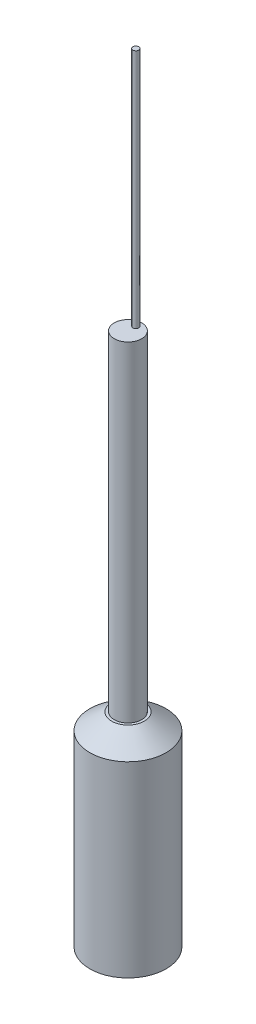
ISO-10303-21;
HEADER;
FILE_DESCRIPTION(('STEP AP214'),'2;1');
FILE_NAME('part.step','',(''),(''),'','','');
FILE_SCHEMA(('AUTOMOTIVE_DESIGN { 1 0 10303 214 1 1 1 1 }'));
ENDSEC;
DATA;
#1=APPLICATION_CONTEXT('core data for automotive mechanical design processes');
#2=APPLICATION_PROTOCOL_DEFINITION('international standard','automotive_design',2000,#1);
#3=PRODUCT_CONTEXT('',#1,'mechanical');
#4=PRODUCT('Part','Part','',(#3));
#5=PRODUCT_RELATED_PRODUCT_CATEGORY('part','',(#4));
#6=PRODUCT_DEFINITION_FORMATION('','',#4);
#7=PRODUCT_DEFINITION_CONTEXT('part definition',#1,'design');
#8=PRODUCT_DEFINITION('design','',#6,#7);
#9=PRODUCT_DEFINITION_SHAPE('','',#8);
#10=(LENGTH_UNIT() NAMED_UNIT(*) SI_UNIT(.MILLI.,.METRE.));
#11=(NAMED_UNIT(*) PLANE_ANGLE_UNIT() SI_UNIT($,.RADIAN.));
#12=(NAMED_UNIT(*) SI_UNIT($,.STERADIAN.) SOLID_ANGLE_UNIT());
#13=UNCERTAINTY_MEASURE_WITH_UNIT(LENGTH_MEASURE(1.E-05),#10,'distance_accuracy_value','');
#14=(GEOMETRIC_REPRESENTATION_CONTEXT(3) GLOBAL_UNCERTAINTY_ASSIGNED_CONTEXT((#13)) GLOBAL_UNIT_ASSIGNED_CONTEXT((#10,
#11,#12)) REPRESENTATION_CONTEXT('',''));
#15=CARTESIAN_POINT('',(0.,0.,0.));
#16=DIRECTION('',(0.,0.,1.));
#17=DIRECTION('',(1.,0.,0.));
#18=AXIS2_PLACEMENT_3D('',#15,#16,#17);
#19=CARTESIAN_POINT('',(0.,29.62,0.));
#20=DIRECTION('',(0.,-1.,0.));
#21=DIRECTION('',(0.,0.,-1.));
#22=AXIS2_PLACEMENT_3D('',#19,#20,#21);
#23=CYLINDRICAL_SURFACE('',#22,5.55);
#24=CARTESIAN_POINT('',(0.,27.24,0.));
#25=DIRECTION('',(0.,1.,0.));
#26=DIRECTION('',(0.,0.,1.));
#27=AXIS2_PLACEMENT_3D('',#24,#25,#26);
#28=CIRCLE('',#27,5.55);
#29=CARTESIAN_POINT('',(0.,27.24,5.55));
#30=VERTEX_POINT('',#29);
#31=EDGE_CURVE('E37',#30,#30,#28,.F.);
#32=ORIENTED_EDGE('',*,*,#31,.T.);
#33=EDGE_LOOP('',(#32));
#34=FACE_BOUND('',#33,.T.);
#35=CARTESIAN_POINT('',(0.,0.,0.));
#36=DIRECTION('',(0.,1.,0.));
#37=DIRECTION('',(0.,0.,1.));
#38=AXIS2_PLACEMENT_3D('',#35,#36,#37);
#39=CIRCLE('',#38,5.55);
#40=CARTESIAN_POINT('',(0.,0.,5.55));
#41=VERTEX_POINT('',#40);
#42=EDGE_CURVE('E50',#41,#41,#39,.T.);
#43=ORIENTED_EDGE('',*,*,#42,.T.);
#44=EDGE_LOOP('',(#43));
#45=FACE_BOUND('',#44,.T.);
#46=ADVANCED_FACE('F33',(#34,#45),#23,.T.);
#47=CARTESIAN_POINT('',(0.,29.62,0.));
#48=DIRECTION('',(0.,1.,0.));
#49=DIRECTION('',(0.,0.,1.));
#50=AXIS2_PLACEMENT_3D('',#47,#48,#49);
#51=PLANE('',#50);
#52=CARTESIAN_POINT('',(0.,29.62,0.));
#53=DIRECTION('',(0.,1.,0.));
#54=DIRECTION('',(0.,0.,1.));
#55=AXIS2_PLACEMENT_3D('',#52,#53,#54);
#56=CIRCLE('',#55,2.);
#57=CARTESIAN_POINT('',(0.,29.62,2.));
#58=VERTEX_POINT('',#57);
#59=EDGE_CURVE('E10',#58,#58,#56,.T.);
#60=ORIENTED_EDGE('',*,*,#59,.F.);
#61=EDGE_LOOP('',(#60));
#62=FACE_BOUND('',#61,.T.);
#63=CARTESIAN_POINT('',(0.,29.62,0.));
#64=DIRECTION('',(0.,1.,0.));
#65=DIRECTION('',(0.,0.,1.));
#66=AXIS2_PLACEMENT_3D('',#63,#64,#65);
#67=CIRCLE('',#66,2.37499999999999);
#68=CARTESIAN_POINT('',(0.,29.62,2.37499999999999));
#69=VERTEX_POINT('',#68);
#70=EDGE_CURVE('E45',#69,#69,#67,.T.);
#71=ORIENTED_EDGE('',*,*,#70,.T.);
#72=EDGE_LOOP('',(#71));
#73=FACE_BOUND('',#72,.T.);
#74=ADVANCED_FACE('F55',(#62,#73),#51,.T.);
#75=CARTESIAN_POINT('',(0.,0.,0.));
#76=DIRECTION('',(0.,1.,0.));
#77=DIRECTION('',(0.,0.,1.));
#78=AXIS2_PLACEMENT_3D('',#75,#76,#77);
#79=PLANE('',#78);
#80=ORIENTED_EDGE('',*,*,#42,.F.);
#81=EDGE_LOOP('',(#80));
#82=FACE_BOUND('',#81,.T.);
#83=ADVANCED_FACE('F59',(#82),#79,.F.);
#84=CARTESIAN_POINT('',(0.,29.62,0.));
#85=DIRECTION('',(0.,-1.,0.));
#86=DIRECTION('',(0.,0.,-1.));
#87=AXIS2_PLACEMENT_3D('',#84,#85,#86);
#88=CONICAL_SURFACE('',#87,2.37499999999999,0.92754723412531);
#89=ORIENTED_EDGE('',*,*,#31,.F.);
#90=EDGE_LOOP('',(#89));
#91=FACE_BOUND('',#90,.T.);
#92=ORIENTED_EDGE('',*,*,#70,.F.);
#93=EDGE_LOOP('',(#92));
#94=FACE_BOUND('',#93,.T.);
#95=ADVANCED_FACE('F35',(#91,#94),#88,.T.);
#96=CARTESIAN_POINT('',(0.,77.62,0.));
#97=DIRECTION('',(0.,-1.,0.));
#98=DIRECTION('',(0.,0.,-1.));
#99=AXIS2_PLACEMENT_3D('',#96,#97,#98);
#100=CYLINDRICAL_SURFACE('',#99,2.);
#101=CARTESIAN_POINT('',(0.,77.62,0.));
#102=DIRECTION('',(0.,1.,0.));
#103=DIRECTION('',(0.,0.,1.));
#104=AXIS2_PLACEMENT_3D('',#101,#102,#103);
#105=CIRCLE('',#104,2.);
#106=CARTESIAN_POINT('',(0.,77.62,2.));
#107=VERTEX_POINT('',#106);
#108=EDGE_CURVE('E48',#107,#107,#105,.T.);
#109=ORIENTED_EDGE('',*,*,#108,.F.);
#110=EDGE_LOOP('',(#109));
#111=FACE_BOUND('',#110,.T.);
#112=ORIENTED_EDGE('',*,*,#59,.T.);
#113=EDGE_LOOP('',(#112));
#114=FACE_BOUND('',#113,.T.);
#115=ADVANCED_FACE('F58',(#111,#114),#100,.T.);
#116=CARTESIAN_POINT('',(0.,77.62,0.));
#117=DIRECTION('',(0.,1.,0.));
#118=DIRECTION('',(0.,0.,1.));
#119=AXIS2_PLACEMENT_3D('',#116,#117,#118);
#120=PLANE('',#119);
#121=CARTESIAN_POINT('',(0.,77.62,-1.1433120958344));
#122=DIRECTION('',(0.,1.,0.));
#123=DIRECTION('',(0.,0.,1.));
#124=AXIS2_PLACEMENT_3D('',#121,#122,#123);
#125=CIRCLE('',#124,0.43);
#126=CARTESIAN_POINT('',(0.,77.62,-0.713312095834403));
#127=VERTEX_POINT('',#126);
#128=EDGE_CURVE('E95',#127,#127,#125,.T.);
#129=ORIENTED_EDGE('',*,*,#128,.F.);
#130=EDGE_LOOP('',(#129));
#131=FACE_BOUND('',#130,.T.);
#132=ORIENTED_EDGE('',*,*,#108,.T.);
#133=EDGE_LOOP('',(#132));
#134=FACE_BOUND('',#133,.T.);
#135=ADVANCED_FACE('F65',(#131,#134),#120,.T.);
#136=CARTESIAN_POINT('',(0.,112.62,-1.1433120958344));
#137=DIRECTION('',(0.,-1.,0.));
#138=DIRECTION('',(0.,0.,-1.));
#139=AXIS2_PLACEMENT_3D('',#136,#137,#138);
#140=CYLINDRICAL_SURFACE('',#139,0.43);
#141=CARTESIAN_POINT('',(0.,112.62,-1.1433120958344));
#142=DIRECTION('',(0.,1.,0.));
#143=DIRECTION('',(0.,0.,1.));
#144=AXIS2_PLACEMENT_3D('',#141,#142,#143);
#145=CIRCLE('',#144,0.43);
#146=CARTESIAN_POINT('',(0.,112.62,-0.713312095834403));
#147=VERTEX_POINT('',#146);
#148=EDGE_CURVE('E94',#147,#147,#145,.T.);
#149=ORIENTED_EDGE('',*,*,#148,.F.);
#150=EDGE_LOOP('',(#149));
#151=FACE_BOUND('',#150,.T.);
#152=ORIENTED_EDGE('',*,*,#128,.T.);
#153=EDGE_LOOP('',(#152));
#154=FACE_BOUND('',#153,.T.);
#155=ADVANCED_FACE('F82',(#151,#154),#140,.T.);
#156=CARTESIAN_POINT('',(0.,112.62,-1.1433120958344));
#157=DIRECTION('',(0.,1.,0.));
#158=DIRECTION('',(0.,0.,1.));
#159=AXIS2_PLACEMENT_3D('',#156,#157,#158);
#160=PLANE('',#159);
#161=ORIENTED_EDGE('',*,*,#148,.T.);
#162=EDGE_LOOP('',(#161));
#163=FACE_BOUND('',#162,.T.);
#164=ADVANCED_FACE('F86',(#163),#160,.T.);
#165=CLOSED_SHELL('',(#46,#74,#83,#95,#115,#135,#155,#164));
#166=MANIFOLD_SOLID_BREP('B2',#165);
#167=ADVANCED_BREP_SHAPE_REPRESENTATION('',(#18,#166),#14);
#168=SHAPE_DEFINITION_REPRESENTATION(#9,#167);
ENDSEC;
END-ISO-10303-21;
